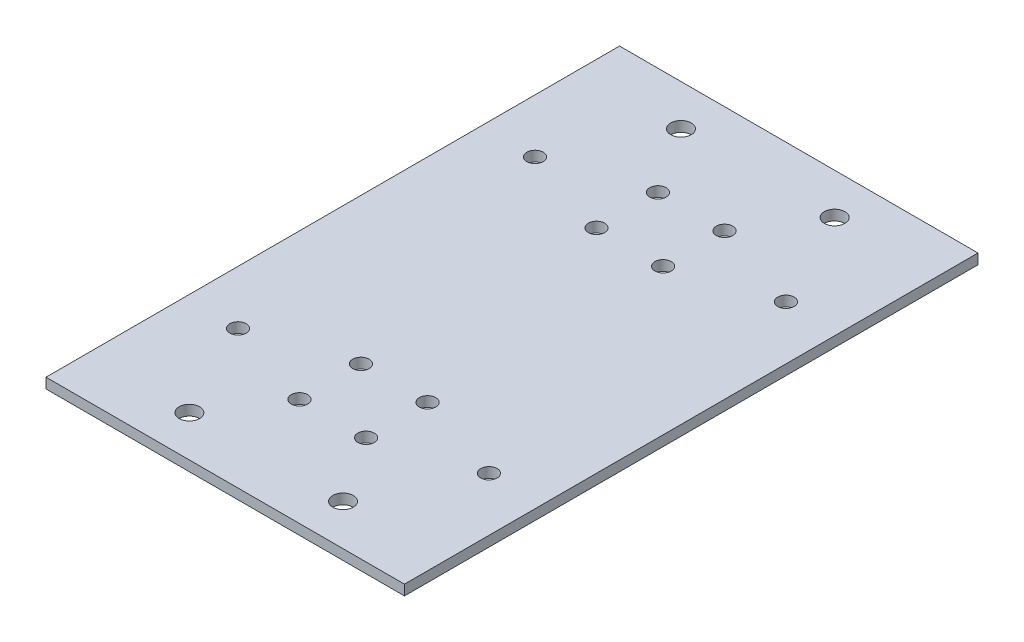
ISO-10303-21;
HEADER;
FILE_DESCRIPTION(('STEP AP214'),'2;1');
FILE_NAME('part.step','',(''),(''),'','','');
FILE_SCHEMA(('AUTOMOTIVE_DESIGN { 1 0 10303 214 1 1 1 1 }'));
ENDSEC;
DATA;
#1=APPLICATION_CONTEXT('core data for automotive mechanical design processes');
#2=APPLICATION_PROTOCOL_DEFINITION('international standard','automotive_design',2000,#1);
#3=PRODUCT_CONTEXT('',#1,'mechanical');
#4=PRODUCT('Part','Part','',(#3));
#5=PRODUCT_RELATED_PRODUCT_CATEGORY('part','',(#4));
#6=PRODUCT_DEFINITION_FORMATION('','',#4);
#7=PRODUCT_DEFINITION_CONTEXT('part definition',#1,'design');
#8=PRODUCT_DEFINITION('design','',#6,#7);
#9=PRODUCT_DEFINITION_SHAPE('','',#8);
#10=(LENGTH_UNIT() NAMED_UNIT(*) SI_UNIT(.MILLI.,.METRE.));
#11=(NAMED_UNIT(*) PLANE_ANGLE_UNIT() SI_UNIT($,.RADIAN.));
#12=(NAMED_UNIT(*) SI_UNIT($,.STERADIAN.) SOLID_ANGLE_UNIT());
#13=UNCERTAINTY_MEASURE_WITH_UNIT(LENGTH_MEASURE(1.E-05),#10,'distance_accuracy_value','');
#14=(GEOMETRIC_REPRESENTATION_CONTEXT(3) GLOBAL_UNCERTAINTY_ASSIGNED_CONTEXT((#13)) GLOBAL_UNIT_ASSIGNED_CONTEXT((#10,
#11,#12)) REPRESENTATION_CONTEXT('',''));
#15=CARTESIAN_POINT('',(0.,0.,0.));
#16=DIRECTION('',(0.,0.,1.));
#17=DIRECTION('',(1.,0.,0.));
#18=AXIS2_PLACEMENT_3D('',#15,#16,#17);
#19=CARTESIAN_POINT('',(0.,2.,0.));
#20=DIRECTION('',(0.,-1.,0.));
#21=DIRECTION('',(0.,0.,-1.));
#22=AXIS2_PLACEMENT_3D('',#19,#20,#21);
#23=PLANE('',#22);
#24=CARTESIAN_POINT('',(-15.,2.,-48.));
#25=DIRECTION('',(0.,1.,0.));
#26=DIRECTION('',(0.,0.,-1.));
#27=AXIS2_PLACEMENT_3D('',#24,#25,#26);
#28=CIRCLE('',#27,2.);
#29=CARTESIAN_POINT('',(-15.,2.,-50.));
#30=VERTEX_POINT('',#29);
#31=EDGE_CURVE('E204',#30,#30,#28,.T.);
#32=ORIENTED_EDGE('',*,*,#31,.F.);
#33=EDGE_LOOP('',(#32));
#34=FACE_BOUND('',#33,.T.);
#35=CARTESIAN_POINT('',(15.,2.,48.));
#36=DIRECTION('',(0.,1.,0.));
#37=DIRECTION('',(0.,0.,-1.));
#38=AXIS2_PLACEMENT_3D('',#35,#36,#37);
#39=CIRCLE('',#38,2.);
#40=CARTESIAN_POINT('',(15.,2.,46.));
#41=VERTEX_POINT('',#40);
#42=EDGE_CURVE('E198',#41,#41,#39,.T.);
#43=ORIENTED_EDGE('',*,*,#42,.F.);
#44=EDGE_LOOP('',(#43));
#45=FACE_BOUND('',#44,.T.);
#46=CARTESIAN_POINT('',(15.,2.,-48.));
#47=DIRECTION('',(0.,1.,0.));
#48=DIRECTION('',(0.,0.,1.));
#49=AXIS2_PLACEMENT_3D('',#46,#47,#48);
#50=CIRCLE('',#49,2.);
#51=CARTESIAN_POINT('',(15.,2.,-46.));
#52=VERTEX_POINT('',#51);
#53=EDGE_CURVE('E192',#52,#52,#50,.T.);
#54=ORIENTED_EDGE('',*,*,#53,.F.);
#55=EDGE_LOOP('',(#54));
#56=FACE_BOUND('',#55,.T.);
#57=CARTESIAN_POINT('',(-15.,2.,48.));
#58=DIRECTION('',(0.,1.,0.));
#59=DIRECTION('',(0.,0.,1.));
#60=AXIS2_PLACEMENT_3D('',#57,#58,#59);
#61=CIRCLE('',#60,2.);
#62=CARTESIAN_POINT('',(-15.,2.,50.));
#63=VERTEX_POINT('',#62);
#64=EDGE_CURVE('E186',#63,#63,#61,.T.);
#65=ORIENTED_EDGE('',*,*,#64,.F.);
#66=EDGE_LOOP('',(#65));
#67=FACE_BOUND('',#66,.T.);
#68=DIRECTION('',(0.,0.,-1.));
#69=VECTOR('',#68,1.);
#70=CARTESIAN_POINT('',(35.,2.,56.));
#71=LINE('',#70,#69);
#72=CARTESIAN_POINT('',(35.,2.,56.));
#73=VERTEX_POINT('',#72);
#74=CARTESIAN_POINT('',(35.,2.,-56.));
#75=VERTEX_POINT('',#74);
#76=EDGE_CURVE('E87',#73,#75,#71,.T.);
#77=ORIENTED_EDGE('',*,*,#76,.T.);
#78=DIRECTION('',(-1.,0.,0.));
#79=VECTOR('',#78,1.);
#80=CARTESIAN_POINT('',(-35.,2.,-56.));
#81=LINE('',#80,#79);
#82=CARTESIAN_POINT('',(-35.,2.,-56.));
#83=VERTEX_POINT('',#82);
#84=EDGE_CURVE('E82',#75,#83,#81,.T.);
#85=ORIENTED_EDGE('',*,*,#84,.T.);
#86=DIRECTION('',(0.,0.,1.));
#87=VECTOR('',#86,1.);
#88=CARTESIAN_POINT('',(-35.,2.,56.));
#89=LINE('',#88,#87);
#90=CARTESIAN_POINT('',(-35.,2.,56.));
#91=VERTEX_POINT('',#90);
#92=EDGE_CURVE('E85',#83,#91,#89,.T.);
#93=ORIENTED_EDGE('',*,*,#92,.T.);
#94=DIRECTION('',(1.,0.,0.));
#95=VECTOR('',#94,1.);
#96=CARTESIAN_POINT('',(-35.,2.,56.));
#97=LINE('',#96,#95);
#98=EDGE_CURVE('E52',#91,#73,#97,.T.);
#99=ORIENTED_EDGE('',*,*,#98,.T.);
#100=EDGE_LOOP('',(#77,#85,#93,#99));
#101=FACE_BOUND('',#100,.T.);
#102=CARTESIAN_POINT('',(-6.49999999999999,2.,35.));
#103=DIRECTION('',(0.,1.,0.));
#104=DIRECTION('',(0.,0.,-1.));
#105=AXIS2_PLACEMENT_3D('',#102,#103,#104);
#106=CIRCLE('',#105,1.6);
#107=CARTESIAN_POINT('',(-6.49999999999999,2.,33.4));
#108=VERTEX_POINT('',#107);
#109=EDGE_CURVE('E102',#108,#108,#106,.T.);
#110=ORIENTED_EDGE('',*,*,#109,.F.);
#111=EDGE_LOOP('',(#110));
#112=FACE_BOUND('',#111,.T.);
#113=CARTESIAN_POINT('',(-6.49999999999999,2.,-35.));
#114=DIRECTION('',(0.,1.,0.));
#115=DIRECTION('',(0.,0.,1.));
#116=AXIS2_PLACEMENT_3D('',#113,#114,#115);
#117=CIRCLE('',#116,1.6);
#118=CARTESIAN_POINT('',(-6.49999999999999,2.,-33.4));
#119=VERTEX_POINT('',#118);
#120=EDGE_CURVE('E117',#119,#119,#117,.T.);
#121=ORIENTED_EDGE('',*,*,#120,.F.);
#122=EDGE_LOOP('',(#121));
#123=FACE_BOUND('',#122,.T.);
#124=CARTESIAN_POINT('',(-6.49999999999999,2.,-23.));
#125=DIRECTION('',(0.,1.,0.));
#126=DIRECTION('',(0.,0.,1.));
#127=AXIS2_PLACEMENT_3D('',#124,#125,#126);
#128=CIRCLE('',#127,1.6);
#129=CARTESIAN_POINT('',(-6.49999999999999,2.,-21.4));
#130=VERTEX_POINT('',#129);
#131=EDGE_CURVE('E123',#130,#130,#128,.T.);
#132=ORIENTED_EDGE('',*,*,#131,.F.);
#133=EDGE_LOOP('',(#132));
#134=FACE_BOUND('',#133,.T.);
#135=CARTESIAN_POINT('',(-6.49999999999999,2.,23.));
#136=DIRECTION('',(0.,1.,0.));
#137=DIRECTION('',(0.,0.,-1.));
#138=AXIS2_PLACEMENT_3D('',#135,#136,#137);
#139=CIRCLE('',#138,1.6);
#140=CARTESIAN_POINT('',(-6.49999999999999,2.,21.4));
#141=VERTEX_POINT('',#140);
#142=EDGE_CURVE('E129',#141,#141,#139,.T.);
#143=ORIENTED_EDGE('',*,*,#142,.F.);
#144=EDGE_LOOP('',(#143));
#145=FACE_BOUND('',#144,.T.);
#146=CARTESIAN_POINT('',(6.50000000000001,2.,35.));
#147=DIRECTION('',(0.,1.,0.));
#148=DIRECTION('',(0.,0.,1.));
#149=AXIS2_PLACEMENT_3D('',#146,#147,#148);
#150=CIRCLE('',#149,1.6);
#151=CARTESIAN_POINT('',(6.50000000000001,2.,36.6));
#152=VERTEX_POINT('',#151);
#153=EDGE_CURVE('E135',#152,#152,#150,.T.);
#154=ORIENTED_EDGE('',*,*,#153,.F.);
#155=EDGE_LOOP('',(#154));
#156=FACE_BOUND('',#155,.T.);
#157=CARTESIAN_POINT('',(6.50000000000001,2.,23.));
#158=DIRECTION('',(0.,1.,0.));
#159=DIRECTION('',(0.,0.,1.));
#160=AXIS2_PLACEMENT_3D('',#157,#158,#159);
#161=CIRCLE('',#160,1.6);
#162=CARTESIAN_POINT('',(6.50000000000001,2.,24.6));
#163=VERTEX_POINT('',#162);
#164=EDGE_CURVE('E141',#163,#163,#161,.T.);
#165=ORIENTED_EDGE('',*,*,#164,.F.);
#166=EDGE_LOOP('',(#165));
#167=FACE_BOUND('',#166,.T.);
#168=CARTESIAN_POINT('',(6.50000000000001,2.,-23.));
#169=DIRECTION('',(0.,1.,0.));
#170=DIRECTION('',(0.,0.,-1.));
#171=AXIS2_PLACEMENT_3D('',#168,#169,#170);
#172=CIRCLE('',#171,1.6);
#173=CARTESIAN_POINT('',(6.50000000000001,2.,-24.6));
#174=VERTEX_POINT('',#173);
#175=EDGE_CURVE('E147',#174,#174,#172,.T.);
#176=ORIENTED_EDGE('',*,*,#175,.F.);
#177=EDGE_LOOP('',(#176));
#178=FACE_BOUND('',#177,.T.);
#179=CARTESIAN_POINT('',(6.50000000000001,2.,-35.));
#180=DIRECTION('',(0.,1.,0.));
#181=DIRECTION('',(0.,0.,-1.));
#182=AXIS2_PLACEMENT_3D('',#179,#180,#181);
#183=CIRCLE('',#182,1.6);
#184=CARTESIAN_POINT('',(6.50000000000001,2.,-36.6));
#185=VERTEX_POINT('',#184);
#186=EDGE_CURVE('E153',#185,#185,#183,.T.);
#187=ORIENTED_EDGE('',*,*,#186,.F.);
#188=EDGE_LOOP('',(#187));
#189=FACE_BOUND('',#188,.T.);
#190=CARTESIAN_POINT('',(-24.5,2.,-29.));
#191=DIRECTION('',(0.,1.,0.));
#192=DIRECTION('',(0.,0.,1.));
#193=AXIS2_PLACEMENT_3D('',#190,#191,#192);
#194=CIRCLE('',#193,1.6);
#195=CARTESIAN_POINT('',(-24.5,2.,-27.4));
#196=VERTEX_POINT('',#195);
#197=EDGE_CURVE('E159',#196,#196,#194,.T.);
#198=ORIENTED_EDGE('',*,*,#197,.F.);
#199=EDGE_LOOP('',(#198));
#200=FACE_BOUND('',#199,.T.);
#201=CARTESIAN_POINT('',(24.5,2.,-29.));
#202=DIRECTION('',(0.,1.,0.));
#203=DIRECTION('',(0.,0.,-1.));
#204=AXIS2_PLACEMENT_3D('',#201,#202,#203);
#205=CIRCLE('',#204,1.6);
#206=CARTESIAN_POINT('',(24.5,2.,-30.6));
#207=VERTEX_POINT('',#206);
#208=EDGE_CURVE('E165',#207,#207,#205,.T.);
#209=ORIENTED_EDGE('',*,*,#208,.F.);
#210=EDGE_LOOP('',(#209));
#211=FACE_BOUND('',#210,.T.);
#212=CARTESIAN_POINT('',(-24.5,2.,29.));
#213=DIRECTION('',(0.,1.,0.));
#214=DIRECTION('',(0.,0.,-1.));
#215=AXIS2_PLACEMENT_3D('',#212,#213,#214);
#216=CIRCLE('',#215,1.6);
#217=CARTESIAN_POINT('',(-24.5,2.,27.4));
#218=VERTEX_POINT('',#217);
#219=EDGE_CURVE('E171',#218,#218,#216,.T.);
#220=ORIENTED_EDGE('',*,*,#219,.F.);
#221=EDGE_LOOP('',(#220));
#222=FACE_BOUND('',#221,.T.);
#223=CARTESIAN_POINT('',(24.5,2.,29.));
#224=DIRECTION('',(0.,1.,0.));
#225=DIRECTION('',(0.,0.,1.));
#226=AXIS2_PLACEMENT_3D('',#223,#224,#225);
#227=CIRCLE('',#226,1.6);
#228=CARTESIAN_POINT('',(24.5,2.,30.6));
#229=VERTEX_POINT('',#228);
#230=EDGE_CURVE('E177',#229,#229,#227,.T.);
#231=ORIENTED_EDGE('',*,*,#230,.F.);
#232=EDGE_LOOP('',(#231));
#233=FACE_BOUND('',#232,.T.);
#234=ADVANCED_FACE('F35',(#34,#45,#56,#67,#101,#112,#123,#134,#145,#156,#167,#178,#189,#200,
#211,#222,#233),#23,.F.);
#235=CARTESIAN_POINT('',(0.,0.,0.));
#236=DIRECTION('',(0.,-1.,0.));
#237=DIRECTION('',(0.,0.,-1.));
#238=AXIS2_PLACEMENT_3D('',#235,#236,#237);
#239=PLANE('',#238);
#240=CARTESIAN_POINT('',(-15.,0.,-48.));
#241=DIRECTION('',(0.,1.,0.));
#242=DIRECTION('',(0.,0.,-1.));
#243=AXIS2_PLACEMENT_3D('',#240,#241,#242);
#244=CIRCLE('',#243,2.);
#245=CARTESIAN_POINT('',(-15.,0.,-50.));
#246=VERTEX_POINT('',#245);
#247=EDGE_CURVE('E189',#246,#246,#244,.T.);
#248=ORIENTED_EDGE('',*,*,#247,.T.);
#249=EDGE_LOOP('',(#248));
#250=FACE_BOUND('',#249,.T.);
#251=CARTESIAN_POINT('',(15.,0.,48.));
#252=DIRECTION('',(0.,1.,0.));
#253=DIRECTION('',(0.,0.,-1.));
#254=AXIS2_PLACEMENT_3D('',#251,#252,#253);
#255=CIRCLE('',#254,2.);
#256=CARTESIAN_POINT('',(15.,0.,46.));
#257=VERTEX_POINT('',#256);
#258=EDGE_CURVE('E201',#257,#257,#255,.T.);
#259=ORIENTED_EDGE('',*,*,#258,.T.);
#260=EDGE_LOOP('',(#259));
#261=FACE_BOUND('',#260,.T.);
#262=CARTESIAN_POINT('',(15.,0.,-48.));
#263=DIRECTION('',(0.,1.,0.));
#264=DIRECTION('',(0.,0.,1.));
#265=AXIS2_PLACEMENT_3D('',#262,#263,#264);
#266=CIRCLE('',#265,2.);
#267=CARTESIAN_POINT('',(15.,0.,-46.));
#268=VERTEX_POINT('',#267);
#269=EDGE_CURVE('E195',#268,#268,#266,.T.);
#270=ORIENTED_EDGE('',*,*,#269,.T.);
#271=EDGE_LOOP('',(#270));
#272=FACE_BOUND('',#271,.T.);
#273=CARTESIAN_POINT('',(-15.,0.,48.));
#274=DIRECTION('',(0.,1.,0.));
#275=DIRECTION('',(0.,0.,1.));
#276=AXIS2_PLACEMENT_3D('',#273,#274,#275);
#277=CIRCLE('',#276,2.);
#278=CARTESIAN_POINT('',(-15.,0.,50.));
#279=VERTEX_POINT('',#278);
#280=EDGE_CURVE('E183',#279,#279,#277,.T.);
#281=ORIENTED_EDGE('',*,*,#280,.T.);
#282=EDGE_LOOP('',(#281));
#283=FACE_BOUND('',#282,.T.);
#284=CARTESIAN_POINT('',(-24.5,0.,29.));
#285=DIRECTION('',(0.,1.,0.));
#286=DIRECTION('',(0.,0.,-1.));
#287=AXIS2_PLACEMENT_3D('',#284,#285,#286);
#288=CIRCLE('',#287,1.6);
#289=CARTESIAN_POINT('',(-24.5,0.,27.4));
#290=VERTEX_POINT('',#289);
#291=EDGE_CURVE('E174',#290,#290,#288,.T.);
#292=ORIENTED_EDGE('',*,*,#291,.T.);
#293=EDGE_LOOP('',(#292));
#294=FACE_BOUND('',#293,.T.);
#295=CARTESIAN_POINT('',(-24.5,0.,-29.));
#296=DIRECTION('',(0.,1.,0.));
#297=DIRECTION('',(0.,0.,1.));
#298=AXIS2_PLACEMENT_3D('',#295,#296,#297);
#299=CIRCLE('',#298,1.6);
#300=CARTESIAN_POINT('',(-24.5,0.,-27.4));
#301=VERTEX_POINT('',#300);
#302=EDGE_CURVE('E162',#301,#301,#299,.T.);
#303=ORIENTED_EDGE('',*,*,#302,.T.);
#304=EDGE_LOOP('',(#303));
#305=FACE_BOUND('',#304,.T.);
#306=CARTESIAN_POINT('',(6.50000000000001,0.,-23.));
#307=DIRECTION('',(0.,1.,0.));
#308=DIRECTION('',(0.,0.,-1.));
#309=AXIS2_PLACEMENT_3D('',#306,#307,#308);
#310=CIRCLE('',#309,1.6);
#311=CARTESIAN_POINT('',(6.50000000000001,0.,-24.6));
#312=VERTEX_POINT('',#311);
#313=EDGE_CURVE('E150',#312,#312,#310,.T.);
#314=ORIENTED_EDGE('',*,*,#313,.T.);
#315=EDGE_LOOP('',(#314));
#316=FACE_BOUND('',#315,.T.);
#317=CARTESIAN_POINT('',(6.50000000000001,0.,35.));
#318=DIRECTION('',(0.,1.,0.));
#319=DIRECTION('',(0.,0.,1.));
#320=AXIS2_PLACEMENT_3D('',#317,#318,#319);
#321=CIRCLE('',#320,1.6);
#322=CARTESIAN_POINT('',(6.50000000000001,0.,36.6));
#323=VERTEX_POINT('',#322);
#324=EDGE_CURVE('E138',#323,#323,#321,.T.);
#325=ORIENTED_EDGE('',*,*,#324,.T.);
#326=EDGE_LOOP('',(#325));
#327=FACE_BOUND('',#326,.T.);
#328=CARTESIAN_POINT('',(-6.49999999999999,0.,-23.));
#329=DIRECTION('',(0.,1.,0.));
#330=DIRECTION('',(0.,0.,1.));
#331=AXIS2_PLACEMENT_3D('',#328,#329,#330);
#332=CIRCLE('',#331,1.6);
#333=CARTESIAN_POINT('',(-6.49999999999999,0.,-21.4));
#334=VERTEX_POINT('',#333);
#335=EDGE_CURVE('E126',#334,#334,#332,.T.);
#336=ORIENTED_EDGE('',*,*,#335,.T.);
#337=EDGE_LOOP('',(#336));
#338=FACE_BOUND('',#337,.T.);
#339=CARTESIAN_POINT('',(-6.49999999999999,0.,35.));
#340=DIRECTION('',(0.,1.,0.));
#341=DIRECTION('',(0.,0.,-1.));
#342=AXIS2_PLACEMENT_3D('',#339,#340,#341);
#343=CIRCLE('',#342,1.6);
#344=CARTESIAN_POINT('',(-6.49999999999999,0.,33.4));
#345=VERTEX_POINT('',#344);
#346=EDGE_CURVE('E114',#345,#345,#343,.T.);
#347=ORIENTED_EDGE('',*,*,#346,.T.);
#348=EDGE_LOOP('',(#347));
#349=FACE_BOUND('',#348,.T.);
#350=DIRECTION('',(0.,0.,-1.));
#351=VECTOR('',#350,1.);
#352=CARTESIAN_POINT('',(35.,0.,56.));
#353=LINE('',#352,#351);
#354=CARTESIAN_POINT('',(35.,0.,56.));
#355=VERTEX_POINT('',#354);
#356=CARTESIAN_POINT('',(35.,0.,-56.));
#357=VERTEX_POINT('',#356);
#358=EDGE_CURVE('E99',#355,#357,#353,.T.);
#359=ORIENTED_EDGE('',*,*,#358,.F.);
#360=DIRECTION('',(1.,0.,0.));
#361=VECTOR('',#360,1.);
#362=CARTESIAN_POINT('',(-35.,0.,56.));
#363=LINE('',#362,#361);
#364=CARTESIAN_POINT('',(-35.,0.,56.));
#365=VERTEX_POINT('',#364);
#366=EDGE_CURVE('E75',#365,#355,#363,.T.);
#367=ORIENTED_EDGE('',*,*,#366,.F.);
#368=DIRECTION('',(0.,0.,1.));
#369=VECTOR('',#368,1.);
#370=CARTESIAN_POINT('',(-35.,0.,56.));
#371=LINE('',#370,#369);
#372=CARTESIAN_POINT('',(-35.,0.,-56.));
#373=VERTEX_POINT('',#372);
#374=EDGE_CURVE('E69',#373,#365,#371,.T.);
#375=ORIENTED_EDGE('',*,*,#374,.F.);
#376=DIRECTION('',(-1.,0.,0.));
#377=VECTOR('',#376,1.);
#378=CARTESIAN_POINT('',(-35.,0.,-56.));
#379=LINE('',#378,#377);
#380=EDGE_CURVE('E91',#357,#373,#379,.T.);
#381=ORIENTED_EDGE('',*,*,#380,.F.);
#382=EDGE_LOOP('',(#359,#367,#375,#381));
#383=FACE_BOUND('',#382,.T.);
#384=CARTESIAN_POINT('',(-6.49999999999999,0.,-35.));
#385=DIRECTION('',(0.,1.,0.));
#386=DIRECTION('',(0.,0.,1.));
#387=AXIS2_PLACEMENT_3D('',#384,#385,#386);
#388=CIRCLE('',#387,1.6);
#389=CARTESIAN_POINT('',(-6.49999999999999,0.,-33.4));
#390=VERTEX_POINT('',#389);
#391=EDGE_CURVE('E120',#390,#390,#388,.T.);
#392=ORIENTED_EDGE('',*,*,#391,.T.);
#393=EDGE_LOOP('',(#392));
#394=FACE_BOUND('',#393,.T.);
#395=CARTESIAN_POINT('',(-6.49999999999999,0.,23.));
#396=DIRECTION('',(0.,1.,0.));
#397=DIRECTION('',(0.,0.,-1.));
#398=AXIS2_PLACEMENT_3D('',#395,#396,#397);
#399=CIRCLE('',#398,1.6);
#400=CARTESIAN_POINT('',(-6.49999999999999,0.,21.4));
#401=VERTEX_POINT('',#400);
#402=EDGE_CURVE('E132',#401,#401,#399,.T.);
#403=ORIENTED_EDGE('',*,*,#402,.T.);
#404=EDGE_LOOP('',(#403));
#405=FACE_BOUND('',#404,.T.);
#406=CARTESIAN_POINT('',(6.50000000000001,0.,23.));
#407=DIRECTION('',(0.,1.,0.));
#408=DIRECTION('',(0.,0.,1.));
#409=AXIS2_PLACEMENT_3D('',#406,#407,#408);
#410=CIRCLE('',#409,1.6);
#411=CARTESIAN_POINT('',(6.50000000000001,0.,24.6));
#412=VERTEX_POINT('',#411);
#413=EDGE_CURVE('E144',#412,#412,#410,.T.);
#414=ORIENTED_EDGE('',*,*,#413,.T.);
#415=EDGE_LOOP('',(#414));
#416=FACE_BOUND('',#415,.T.);
#417=CARTESIAN_POINT('',(6.50000000000001,0.,-35.));
#418=DIRECTION('',(0.,1.,0.));
#419=DIRECTION('',(0.,0.,-1.));
#420=AXIS2_PLACEMENT_3D('',#417,#418,#419);
#421=CIRCLE('',#420,1.6);
#422=CARTESIAN_POINT('',(6.50000000000001,0.,-36.6));
#423=VERTEX_POINT('',#422);
#424=EDGE_CURVE('E156',#423,#423,#421,.T.);
#425=ORIENTED_EDGE('',*,*,#424,.T.);
#426=EDGE_LOOP('',(#425));
#427=FACE_BOUND('',#426,.T.);
#428=CARTESIAN_POINT('',(24.5,0.,-29.));
#429=DIRECTION('',(0.,1.,0.));
#430=DIRECTION('',(0.,0.,-1.));
#431=AXIS2_PLACEMENT_3D('',#428,#429,#430);
#432=CIRCLE('',#431,1.6);
#433=CARTESIAN_POINT('',(24.5,0.,-30.6));
#434=VERTEX_POINT('',#433);
#435=EDGE_CURVE('E168',#434,#434,#432,.T.);
#436=ORIENTED_EDGE('',*,*,#435,.T.);
#437=EDGE_LOOP('',(#436));
#438=FACE_BOUND('',#437,.T.);
#439=CARTESIAN_POINT('',(24.5,0.,29.));
#440=DIRECTION('',(0.,1.,0.));
#441=DIRECTION('',(0.,0.,1.));
#442=AXIS2_PLACEMENT_3D('',#439,#440,#441);
#443=CIRCLE('',#442,1.6);
#444=CARTESIAN_POINT('',(24.5,0.,30.6));
#445=VERTEX_POINT('',#444);
#446=EDGE_CURVE('E180',#445,#445,#443,.T.);
#447=ORIENTED_EDGE('',*,*,#446,.T.);
#448=EDGE_LOOP('',(#447));
#449=FACE_BOUND('',#448,.T.);
#450=ADVANCED_FACE('F110',(#250,#261,#272,#283,#294,#305,#316,#327,#338,#349,#383,#394,#405,
#416,#427,#438,#449),#239,.T.);
#451=CARTESIAN_POINT('',(35.,2.,56.));
#452=DIRECTION('',(-1.,0.,0.));
#453=DIRECTION('',(0.,0.,1.));
#454=AXIS2_PLACEMENT_3D('',#451,#452,#453);
#455=PLANE('',#454);
#456=ORIENTED_EDGE('',*,*,#358,.T.);
#457=DIRECTION('',(0.,-1.,0.));
#458=VECTOR('',#457,1.);
#459=CARTESIAN_POINT('',(35.,2.,-56.));
#460=LINE('',#459,#458);
#461=EDGE_CURVE('E11',#75,#357,#460,.T.);
#462=ORIENTED_EDGE('',*,*,#461,.F.);
#463=ORIENTED_EDGE('',*,*,#76,.F.);
#464=DIRECTION('',(0.,-1.,0.));
#465=VECTOR('',#464,1.);
#466=CARTESIAN_POINT('',(35.,2.,56.));
#467=LINE('',#466,#465);
#468=EDGE_CURVE('E95',#73,#355,#467,.T.);
#469=ORIENTED_EDGE('',*,*,#468,.T.);
#470=EDGE_LOOP('',(#456,#462,#463,#469));
#471=FACE_BOUND('',#470,.T.);
#472=ADVANCED_FACE('F37',(#471),#455,.F.);
#473=CARTESIAN_POINT('',(-35.,2.,-56.));
#474=DIRECTION('',(0.,0.,1.));
#475=DIRECTION('',(1.,0.,0.));
#476=AXIS2_PLACEMENT_3D('',#473,#474,#475);
#477=PLANE('',#476);
#478=ORIENTED_EDGE('',*,*,#380,.T.);
#479=DIRECTION('',(0.,-1.,0.));
#480=VECTOR('',#479,1.);
#481=CARTESIAN_POINT('',(-35.,2.,-56.));
#482=LINE('',#481,#480);
#483=EDGE_CURVE('E44',#83,#373,#482,.T.);
#484=ORIENTED_EDGE('',*,*,#483,.F.);
#485=ORIENTED_EDGE('',*,*,#84,.F.);
#486=ORIENTED_EDGE('',*,*,#461,.T.);
#487=EDGE_LOOP('',(#478,#484,#485,#486));
#488=FACE_BOUND('',#487,.T.);
#489=ADVANCED_FACE('F90',(#488),#477,.F.);
#490=CARTESIAN_POINT('',(-35.,2.,56.));
#491=DIRECTION('',(1.,0.,0.));
#492=DIRECTION('',(0.,0.,-1.));
#493=AXIS2_PLACEMENT_3D('',#490,#491,#492);
#494=PLANE('',#493);
#495=ORIENTED_EDGE('',*,*,#374,.T.);
#496=DIRECTION('',(0.,-1.,0.));
#497=VECTOR('',#496,1.);
#498=CARTESIAN_POINT('',(-35.,2.,56.));
#499=LINE('',#498,#497);
#500=EDGE_CURVE('E92',#91,#365,#499,.T.);
#501=ORIENTED_EDGE('',*,*,#500,.F.);
#502=ORIENTED_EDGE('',*,*,#92,.F.);
#503=ORIENTED_EDGE('',*,*,#483,.T.);
#504=EDGE_LOOP('',(#495,#501,#502,#503));
#505=FACE_BOUND('',#504,.T.);
#506=ADVANCED_FACE('F93',(#505),#494,.F.);
#507=CARTESIAN_POINT('',(-35.,2.,56.));
#508=DIRECTION('',(0.,0.,-1.));
#509=DIRECTION('',(-1.,0.,0.));
#510=AXIS2_PLACEMENT_3D('',#507,#508,#509);
#511=PLANE('',#510);
#512=ORIENTED_EDGE('',*,*,#366,.T.);
#513=ORIENTED_EDGE('',*,*,#468,.F.);
#514=ORIENTED_EDGE('',*,*,#98,.F.);
#515=ORIENTED_EDGE('',*,*,#500,.T.);
#516=EDGE_LOOP('',(#512,#513,#514,#515));
#517=FACE_BOUND('',#516,.T.);
#518=ADVANCED_FACE('F107',(#517),#511,.F.);
#519=CARTESIAN_POINT('',(-6.49999999999999,2.,35.));
#520=DIRECTION('',(0.,-1.,0.));
#521=DIRECTION('',(0.,0.,-1.));
#522=AXIS2_PLACEMENT_3D('',#519,#520,#521);
#523=CYLINDRICAL_SURFACE('',#522,1.6);
#524=ORIENTED_EDGE('',*,*,#109,.T.);
#525=EDGE_LOOP('',(#524));
#526=FACE_BOUND('',#525,.T.);
#527=ORIENTED_EDGE('',*,*,#346,.F.);
#528=EDGE_LOOP('',(#527));
#529=FACE_BOUND('',#528,.T.);
#530=ADVANCED_FACE('F284',(#526,#529),#523,.F.);
#531=CARTESIAN_POINT('',(-6.49999999999999,2.,-35.));
#532=DIRECTION('',(0.,-1.,0.));
#533=DIRECTION('',(0.,0.,-1.));
#534=AXIS2_PLACEMENT_3D('',#531,#532,#533);
#535=CYLINDRICAL_SURFACE('',#534,1.6);
#536=ORIENTED_EDGE('',*,*,#120,.T.);
#537=EDGE_LOOP('',(#536));
#538=FACE_BOUND('',#537,.T.);
#539=ORIENTED_EDGE('',*,*,#391,.F.);
#540=EDGE_LOOP('',(#539));
#541=FACE_BOUND('',#540,.T.);
#542=ADVANCED_FACE('F280',(#538,#541),#535,.F.);
#543=CARTESIAN_POINT('',(-6.49999999999999,2.,-23.));
#544=DIRECTION('',(0.,-1.,0.));
#545=DIRECTION('',(0.,0.,-1.));
#546=AXIS2_PLACEMENT_3D('',#543,#544,#545);
#547=CYLINDRICAL_SURFACE('',#546,1.6);
#548=ORIENTED_EDGE('',*,*,#131,.T.);
#549=EDGE_LOOP('',(#548));
#550=FACE_BOUND('',#549,.T.);
#551=ORIENTED_EDGE('',*,*,#335,.F.);
#552=EDGE_LOOP('',(#551));
#553=FACE_BOUND('',#552,.T.);
#554=ADVANCED_FACE('F276',(#550,#553),#547,.F.);
#555=CARTESIAN_POINT('',(-6.49999999999999,2.,23.));
#556=DIRECTION('',(0.,-1.,0.));
#557=DIRECTION('',(0.,0.,-1.));
#558=AXIS2_PLACEMENT_3D('',#555,#556,#557);
#559=CYLINDRICAL_SURFACE('',#558,1.6);
#560=ORIENTED_EDGE('',*,*,#142,.T.);
#561=EDGE_LOOP('',(#560));
#562=FACE_BOUND('',#561,.T.);
#563=ORIENTED_EDGE('',*,*,#402,.F.);
#564=EDGE_LOOP('',(#563));
#565=FACE_BOUND('',#564,.T.);
#566=ADVANCED_FACE('F272',(#562,#565),#559,.F.);
#567=CARTESIAN_POINT('',(6.50000000000001,2.,35.));
#568=DIRECTION('',(0.,-1.,0.));
#569=DIRECTION('',(0.,0.,-1.));
#570=AXIS2_PLACEMENT_3D('',#567,#568,#569);
#571=CYLINDRICAL_SURFACE('',#570,1.6);
#572=ORIENTED_EDGE('',*,*,#153,.T.);
#573=EDGE_LOOP('',(#572));
#574=FACE_BOUND('',#573,.T.);
#575=ORIENTED_EDGE('',*,*,#324,.F.);
#576=EDGE_LOOP('',(#575));
#577=FACE_BOUND('',#576,.T.);
#578=ADVANCED_FACE('F268',(#574,#577),#571,.F.);
#579=CARTESIAN_POINT('',(6.50000000000001,2.,23.));
#580=DIRECTION('',(0.,-1.,0.));
#581=DIRECTION('',(0.,0.,-1.));
#582=AXIS2_PLACEMENT_3D('',#579,#580,#581);
#583=CYLINDRICAL_SURFACE('',#582,1.6);
#584=ORIENTED_EDGE('',*,*,#164,.T.);
#585=EDGE_LOOP('',(#584));
#586=FACE_BOUND('',#585,.T.);
#587=ORIENTED_EDGE('',*,*,#413,.F.);
#588=EDGE_LOOP('',(#587));
#589=FACE_BOUND('',#588,.T.);
#590=ADVANCED_FACE('F264',(#586,#589),#583,.F.);
#591=CARTESIAN_POINT('',(6.50000000000001,2.,-23.));
#592=DIRECTION('',(0.,-1.,0.));
#593=DIRECTION('',(0.,0.,-1.));
#594=AXIS2_PLACEMENT_3D('',#591,#592,#593);
#595=CYLINDRICAL_SURFACE('',#594,1.6);
#596=ORIENTED_EDGE('',*,*,#175,.T.);
#597=EDGE_LOOP('',(#596));
#598=FACE_BOUND('',#597,.T.);
#599=ORIENTED_EDGE('',*,*,#313,.F.);
#600=EDGE_LOOP('',(#599));
#601=FACE_BOUND('',#600,.T.);
#602=ADVANCED_FACE('F260',(#598,#601),#595,.F.);
#603=CARTESIAN_POINT('',(6.50000000000001,2.,-35.));
#604=DIRECTION('',(0.,-1.,0.));
#605=DIRECTION('',(0.,0.,-1.));
#606=AXIS2_PLACEMENT_3D('',#603,#604,#605);
#607=CYLINDRICAL_SURFACE('',#606,1.6);
#608=ORIENTED_EDGE('',*,*,#186,.T.);
#609=EDGE_LOOP('',(#608));
#610=FACE_BOUND('',#609,.T.);
#611=ORIENTED_EDGE('',*,*,#424,.F.);
#612=EDGE_LOOP('',(#611));
#613=FACE_BOUND('',#612,.T.);
#614=ADVANCED_FACE('F256',(#610,#613),#607,.F.);
#615=CARTESIAN_POINT('',(-24.5,2.,-29.));
#616=DIRECTION('',(0.,-1.,0.));
#617=DIRECTION('',(0.,0.,-1.));
#618=AXIS2_PLACEMENT_3D('',#615,#616,#617);
#619=CYLINDRICAL_SURFACE('',#618,1.6);
#620=ORIENTED_EDGE('',*,*,#197,.T.);
#621=EDGE_LOOP('',(#620));
#622=FACE_BOUND('',#621,.T.);
#623=ORIENTED_EDGE('',*,*,#302,.F.);
#624=EDGE_LOOP('',(#623));
#625=FACE_BOUND('',#624,.T.);
#626=ADVANCED_FACE('F252',(#622,#625),#619,.F.);
#627=CARTESIAN_POINT('',(24.5,2.,-29.));
#628=DIRECTION('',(0.,-1.,0.));
#629=DIRECTION('',(0.,0.,-1.));
#630=AXIS2_PLACEMENT_3D('',#627,#628,#629);
#631=CYLINDRICAL_SURFACE('',#630,1.6);
#632=ORIENTED_EDGE('',*,*,#208,.T.);
#633=EDGE_LOOP('',(#632));
#634=FACE_BOUND('',#633,.T.);
#635=ORIENTED_EDGE('',*,*,#435,.F.);
#636=EDGE_LOOP('',(#635));
#637=FACE_BOUND('',#636,.T.);
#638=ADVANCED_FACE('F248',(#634,#637),#631,.F.);
#639=CARTESIAN_POINT('',(-24.5,2.,29.));
#640=DIRECTION('',(0.,-1.,0.));
#641=DIRECTION('',(0.,0.,-1.));
#642=AXIS2_PLACEMENT_3D('',#639,#640,#641);
#643=CYLINDRICAL_SURFACE('',#642,1.6);
#644=ORIENTED_EDGE('',*,*,#219,.T.);
#645=EDGE_LOOP('',(#644));
#646=FACE_BOUND('',#645,.T.);
#647=ORIENTED_EDGE('',*,*,#291,.F.);
#648=EDGE_LOOP('',(#647));
#649=FACE_BOUND('',#648,.T.);
#650=ADVANCED_FACE('F240',(#646,#649),#643,.F.);
#651=CARTESIAN_POINT('',(24.5,2.,29.));
#652=DIRECTION('',(0.,-1.,0.));
#653=DIRECTION('',(0.,0.,-1.));
#654=AXIS2_PLACEMENT_3D('',#651,#652,#653);
#655=CYLINDRICAL_SURFACE('',#654,1.6);
#656=ORIENTED_EDGE('',*,*,#230,.T.);
#657=EDGE_LOOP('',(#656));
#658=FACE_BOUND('',#657,.T.);
#659=ORIENTED_EDGE('',*,*,#446,.F.);
#660=EDGE_LOOP('',(#659));
#661=FACE_BOUND('',#660,.T.);
#662=ADVANCED_FACE('F231',(#658,#661),#655,.F.);
#663=CARTESIAN_POINT('',(-15.,0.,48.));
#664=DIRECTION('',(0.,1.,0.));
#665=DIRECTION('',(0.,0.,1.));
#666=AXIS2_PLACEMENT_3D('',#663,#664,#665);
#667=CYLINDRICAL_SURFACE('',#666,2.);
#668=ORIENTED_EDGE('',*,*,#280,.F.);
#669=EDGE_LOOP('',(#668));
#670=FACE_BOUND('',#669,.T.);
#671=ORIENTED_EDGE('',*,*,#64,.T.);
#672=EDGE_LOOP('',(#671));
#673=FACE_BOUND('',#672,.T.);
#674=ADVANCED_FACE('F228',(#670,#673),#667,.F.);
#675=CARTESIAN_POINT('',(15.,0.,-48.));
#676=DIRECTION('',(0.,1.,0.));
#677=DIRECTION('',(0.,0.,1.));
#678=AXIS2_PLACEMENT_3D('',#675,#676,#677);
#679=CYLINDRICAL_SURFACE('',#678,2.);
#680=ORIENTED_EDGE('',*,*,#269,.F.);
#681=EDGE_LOOP('',(#680));
#682=FACE_BOUND('',#681,.T.);
#683=ORIENTED_EDGE('',*,*,#53,.T.);
#684=EDGE_LOOP('',(#683));
#685=FACE_BOUND('',#684,.T.);
#686=ADVANCED_FACE('F230',(#682,#685),#679,.F.);
#687=CARTESIAN_POINT('',(15.,0.,48.));
#688=DIRECTION('',(0.,1.,0.));
#689=DIRECTION('',(0.,0.,1.));
#690=AXIS2_PLACEMENT_3D('',#687,#688,#689);
#691=CYLINDRICAL_SURFACE('',#690,2.);
#692=ORIENTED_EDGE('',*,*,#258,.F.);
#693=EDGE_LOOP('',(#692));
#694=FACE_BOUND('',#693,.T.);
#695=ORIENTED_EDGE('',*,*,#42,.T.);
#696=EDGE_LOOP('',(#695));
#697=FACE_BOUND('',#696,.T.);
#698=ADVANCED_FACE('F215',(#694,#697),#691,.F.);
#699=CARTESIAN_POINT('',(-15.,0.,-48.));
#700=DIRECTION('',(0.,1.,0.));
#701=DIRECTION('',(0.,0.,1.));
#702=AXIS2_PLACEMENT_3D('',#699,#700,#701);
#703=CYLINDRICAL_SURFACE('',#702,2.);
#704=ORIENTED_EDGE('',*,*,#247,.F.);
#705=EDGE_LOOP('',(#704));
#706=FACE_BOUND('',#705,.T.);
#707=ORIENTED_EDGE('',*,*,#31,.T.);
#708=EDGE_LOOP('',(#707));
#709=FACE_BOUND('',#708,.T.);
#710=ADVANCED_FACE('F212',(#706,#709),#703,.F.);
#711=CLOSED_SHELL('',(#234,#450,#472,#489,#506,#518,#530,#542,#554,#566,#578,#590,#602,#614,
#626,#638,#650,#662,#674,#686,#698,#710));
#712=MANIFOLD_SOLID_BREP('B2',#711);
#713=ADVANCED_BREP_SHAPE_REPRESENTATION('',(#18,#712),#14);
#714=SHAPE_DEFINITION_REPRESENTATION(#9,#713);
ENDSEC;
END-ISO-10303-21;
